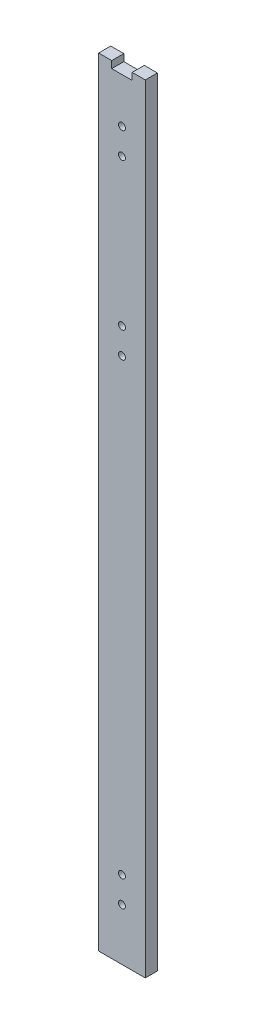
ISO-10303-21;
HEADER;
FILE_DESCRIPTION(('STEP AP214'),'2;1');
FILE_NAME('part.step','',(''),(''),'','','');
FILE_SCHEMA(('AUTOMOTIVE_DESIGN { 1 0 10303 214 1 1 1 1 }'));
ENDSEC;
DATA;
#1=APPLICATION_CONTEXT('core data for automotive mechanical design processes');
#2=APPLICATION_PROTOCOL_DEFINITION('international standard','automotive_design',2000,#1);
#3=PRODUCT_CONTEXT('',#1,'mechanical');
#4=PRODUCT('Part','Part','',(#3));
#5=PRODUCT_RELATED_PRODUCT_CATEGORY('part','',(#4));
#6=PRODUCT_DEFINITION_FORMATION('','',#4);
#7=PRODUCT_DEFINITION_CONTEXT('part definition',#1,'design');
#8=PRODUCT_DEFINITION('design','',#6,#7);
#9=PRODUCT_DEFINITION_SHAPE('','',#8);
#10=(LENGTH_UNIT() NAMED_UNIT(*) SI_UNIT(.MILLI.,.METRE.));
#11=(NAMED_UNIT(*) PLANE_ANGLE_UNIT() SI_UNIT($,.RADIAN.));
#12=(NAMED_UNIT(*) SI_UNIT($,.STERADIAN.) SOLID_ANGLE_UNIT());
#13=UNCERTAINTY_MEASURE_WITH_UNIT(LENGTH_MEASURE(1.E-05),#10,'distance_accuracy_value','');
#14=(GEOMETRIC_REPRESENTATION_CONTEXT(3) GLOBAL_UNCERTAINTY_ASSIGNED_CONTEXT((#13)) GLOBAL_UNIT_ASSIGNED_CONTEXT((#10,
#11,#12)) REPRESENTATION_CONTEXT('',''));
#15=CARTESIAN_POINT('',(0.,0.,0.));
#16=DIRECTION('',(0.,0.,1.));
#17=DIRECTION('',(1.,0.,0.));
#18=AXIS2_PLACEMENT_3D('',#15,#16,#17);
#19=CARTESIAN_POINT('',(0.,450.,0.));
#20=DIRECTION('',(0.,1.,0.));
#21=DIRECTION('',(0.,0.,1.));
#22=AXIS2_PLACEMENT_3D('',#19,#20,#21);
#23=PLANE('',#22);
#24=DIRECTION('',(0.,0.,1.));
#25=VECTOR('',#24,1.);
#26=CARTESIAN_POINT('',(-5.91396309482661,450.,0.));
#27=LINE('',#26,#25);
#28=CARTESIAN_POINT('',(-5.91396309482661,450.,-3.5));
#29=VERTEX_POINT('',#28);
#30=CARTESIAN_POINT('',(-5.91396309482661,450.,3.5));
#31=VERTEX_POINT('',#30);
#32=EDGE_CURVE('E11',#29,#31,#27,.T.);
#33=ORIENTED_EDGE('',*,*,#32,.F.);
#34=DIRECTION('',(-1.,0.,0.));
#35=VECTOR('',#34,1.);
#36=CARTESIAN_POINT('',(13.5,450.,-3.5));
#37=LINE('',#36,#35);
#38=CARTESIAN_POINT('',(-13.5,450.,-3.5));
#39=VERTEX_POINT('',#38);
#40=EDGE_CURVE('E56',#29,#39,#37,.T.);
#41=ORIENTED_EDGE('',*,*,#40,.T.);
#42=DIRECTION('',(0.,0.,1.));
#43=VECTOR('',#42,1.);
#44=CARTESIAN_POINT('',(-13.5,450.,3.5));
#45=LINE('',#44,#43);
#46=CARTESIAN_POINT('',(-13.5,450.,3.5));
#47=VERTEX_POINT('',#46);
#48=EDGE_CURVE('E138',#39,#47,#45,.T.);
#49=ORIENTED_EDGE('',*,*,#48,.T.);
#50=DIRECTION('',(1.,0.,0.));
#51=VECTOR('',#50,1.);
#52=CARTESIAN_POINT('',(13.5,450.,3.5));
#53=LINE('',#52,#51);
#54=EDGE_CURVE('E86',#47,#31,#53,.T.);
#55=ORIENTED_EDGE('',*,*,#54,.T.);
#56=EDGE_LOOP('',(#33,#41,#49,#55));
#57=FACE_BOUND('',#56,.T.);
#58=ADVANCED_FACE('F32',(#57),#23,.T.);
#59=CARTESIAN_POINT('',(-13.5,450.,3.5));
#60=DIRECTION('',(1.,0.,0.));
#61=DIRECTION('',(0.,0.,-1.));
#62=AXIS2_PLACEMENT_3D('',#59,#60,#61);
#63=PLANE('',#62);
#64=DIRECTION('',(0.,0.,1.));
#65=VECTOR('',#64,1.);
#66=CARTESIAN_POINT('',(-13.5,0.,3.5));
#67=LINE('',#66,#65);
#68=CARTESIAN_POINT('',(-13.5,0.,-3.5));
#69=VERTEX_POINT('',#68);
#70=CARTESIAN_POINT('',(-13.5,0.,3.5));
#71=VERTEX_POINT('',#70);
#72=EDGE_CURVE('E136',#69,#71,#67,.T.);
#73=ORIENTED_EDGE('',*,*,#72,.T.);
#74=DIRECTION('',(0.,-1.,0.));
#75=VECTOR('',#74,1.);
#76=CARTESIAN_POINT('',(-13.5,450.,3.5));
#77=LINE('',#76,#75);
#78=EDGE_CURVE('E160',#47,#71,#77,.T.);
#79=ORIENTED_EDGE('',*,*,#78,.F.);
#80=ORIENTED_EDGE('',*,*,#48,.F.);
#81=DIRECTION('',(0.,-1.,0.));
#82=VECTOR('',#81,1.);
#83=CARTESIAN_POINT('',(-13.5,450.,-3.5));
#84=LINE('',#83,#82);
#85=EDGE_CURVE('E146',#39,#69,#84,.T.);
#86=ORIENTED_EDGE('',*,*,#85,.T.);
#87=EDGE_LOOP('',(#73,#79,#80,#86));
#88=FACE_BOUND('',#87,.T.);
#89=ADVANCED_FACE('F34',(#88),#63,.F.);
#90=CARTESIAN_POINT('',(13.5,450.,3.5));
#91=DIRECTION('',(0.,0.,-1.));
#92=DIRECTION('',(-1.,0.,0.));
#93=AXIS2_PLACEMENT_3D('',#90,#91,#92);
#94=PLANE('',#93);
#95=CARTESIAN_POINT('',(0.,405.,3.50000000000001));
#96=DIRECTION('',(0.,0.,-1.));
#97=DIRECTION('',(-1.,0.,0.));
#98=AXIS2_PLACEMENT_3D('',#95,#96,#97);
#99=CIRCLE('',#98,2.);
#100=CARTESIAN_POINT('',(-2.00000000000001,405.,3.50000000000001));
#101=VERTEX_POINT('',#100);
#102=EDGE_CURVE('E206',#101,#101,#99,.T.);
#103=ORIENTED_EDGE('',*,*,#102,.T.);
#104=EDGE_LOOP('',(#103));
#105=FACE_BOUND('',#104,.T.);
#106=CARTESIAN_POINT('',(0.,320.,3.50000000000001));
#107=DIRECTION('',(0.,0.,-1.));
#108=DIRECTION('',(-1.,0.,0.));
#109=AXIS2_PLACEMENT_3D('',#106,#107,#108);
#110=CIRCLE('',#109,2.);
#111=CARTESIAN_POINT('',(-2.00000000000002,320.,3.50000000000001));
#112=VERTEX_POINT('',#111);
#113=EDGE_CURVE('E210',#112,#112,#110,.T.);
#114=ORIENTED_EDGE('',*,*,#113,.T.);
#115=EDGE_LOOP('',(#114));
#116=FACE_BOUND('',#115,.T.);
#117=CARTESIAN_POINT('',(0.,305.,3.50000000000001));
#118=DIRECTION('',(0.,0.,-1.));
#119=DIRECTION('',(-1.,0.,0.));
#120=AXIS2_PLACEMENT_3D('',#117,#118,#119);
#121=CIRCLE('',#120,1.99999999999999);
#122=CARTESIAN_POINT('',(-2.,305.,3.50000000000001));
#123=VERTEX_POINT('',#122);
#124=EDGE_CURVE('E214',#123,#123,#121,.T.);
#125=ORIENTED_EDGE('',*,*,#124,.T.);
#126=EDGE_LOOP('',(#125));
#127=FACE_BOUND('',#126,.T.);
#128=CARTESIAN_POINT('',(0.,30.,3.50000000000001));
#129=DIRECTION('',(0.,0.,-1.));
#130=DIRECTION('',(-1.,0.,0.));
#131=AXIS2_PLACEMENT_3D('',#128,#129,#130);
#132=CIRCLE('',#131,2.00000000000001);
#133=CARTESIAN_POINT('',(-2.00000000000006,30.,3.50000000000001));
#134=VERTEX_POINT('',#133);
#135=EDGE_CURVE('E218',#134,#134,#132,.T.);
#136=ORIENTED_EDGE('',*,*,#135,.T.);
#137=EDGE_LOOP('',(#136));
#138=FACE_BOUND('',#137,.T.);
#139=CARTESIAN_POINT('',(0.,45.,3.50000000000001));
#140=DIRECTION('',(0.,0.,-1.));
#141=DIRECTION('',(-1.,0.,0.));
#142=AXIS2_PLACEMENT_3D('',#139,#140,#141);
#143=CIRCLE('',#142,2.);
#144=CARTESIAN_POINT('',(-2.00000000000005,45.,3.50000000000001));
#145=VERTEX_POINT('',#144);
#146=EDGE_CURVE('E222',#145,#145,#143,.T.);
#147=ORIENTED_EDGE('',*,*,#146,.T.);
#148=EDGE_LOOP('',(#147));
#149=FACE_BOUND('',#148,.T.);
#150=CARTESIAN_POINT('',(0.,420.,3.50000000000001));
#151=DIRECTION('',(0.,0.,-1.));
#152=DIRECTION('',(-1.,0.,0.));
#153=AXIS2_PLACEMENT_3D('',#150,#151,#152);
#154=CIRCLE('',#153,2.);
#155=CARTESIAN_POINT('',(-2.,420.,3.50000000000001));
#156=VERTEX_POINT('',#155);
#157=EDGE_CURVE('E133',#156,#156,#154,.T.);
#158=ORIENTED_EDGE('',*,*,#157,.T.);
#159=EDGE_LOOP('',(#158));
#160=FACE_BOUND('',#159,.T.);
#161=DIRECTION('',(-1.,0.,0.));
#162=VECTOR('',#161,1.);
#163=CARTESIAN_POINT('',(5.91396309482661,445.958983682965,3.5));
#164=LINE('',#163,#162);
#165=CARTESIAN_POINT('',(5.91396309482661,445.958983682965,3.5));
#166=VERTEX_POINT('',#165);
#167=CARTESIAN_POINT('',(-5.91396309482661,445.958983682965,3.5));
#168=VERTEX_POINT('',#167);
#169=EDGE_CURVE('E115',#166,#168,#164,.T.);
#170=ORIENTED_EDGE('',*,*,#169,.T.);
#171=DIRECTION('',(0.,1.,0.));
#172=VECTOR('',#171,1.);
#173=CARTESIAN_POINT('',(-5.91396309482661,445.958983682965,3.5));
#174=LINE('',#173,#172);
#175=EDGE_CURVE('E125',#168,#31,#174,.T.);
#176=ORIENTED_EDGE('',*,*,#175,.T.);
#177=ORIENTED_EDGE('',*,*,#54,.F.);
#178=ORIENTED_EDGE('',*,*,#78,.T.);
#179=DIRECTION('',(1.,0.,0.));
#180=VECTOR('',#179,1.);
#181=CARTESIAN_POINT('',(13.5,0.,3.5));
#182=LINE('',#181,#180);
#183=CARTESIAN_POINT('',(13.5,0.,3.5));
#184=VERTEX_POINT('',#183);
#185=EDGE_CURVE('E149',#71,#184,#182,.T.);
#186=ORIENTED_EDGE('',*,*,#185,.T.);
#187=DIRECTION('',(0.,-1.,0.));
#188=VECTOR('',#187,1.);
#189=CARTESIAN_POINT('',(13.5,450.,3.5));
#190=LINE('',#189,#188);
#191=CARTESIAN_POINT('',(13.5,450.,3.5));
#192=VERTEX_POINT('',#191);
#193=EDGE_CURVE('E157',#192,#184,#190,.T.);
#194=ORIENTED_EDGE('',*,*,#193,.F.);
#195=CARTESIAN_POINT('',(5.91396309482661,450.,3.5));
#196=VERTEX_POINT('',#195);
#197=EDGE_CURVE('E124',#196,#192,#53,.T.);
#198=ORIENTED_EDGE('',*,*,#197,.F.);
#199=DIRECTION('',(0.,-1.,0.));
#200=VECTOR('',#199,1.);
#201=CARTESIAN_POINT('',(5.91396309482661,445.958983682965,3.5));
#202=LINE('',#201,#200);
#203=EDGE_CURVE('E47',#196,#166,#202,.T.);
#204=ORIENTED_EDGE('',*,*,#203,.T.);
#205=EDGE_LOOP('',(#170,#176,#177,#178,#186,#194,#198,#204));
#206=FACE_BOUND('',#205,.T.);
#207=ADVANCED_FACE('F122',(#105,#116,#127,#138,#149,#160,#206),#94,.F.);
#208=CARTESIAN_POINT('',(13.5,450.,3.5));
#209=DIRECTION('',(-1.,0.,0.));
#210=DIRECTION('',(0.,0.,1.));
#211=AXIS2_PLACEMENT_3D('',#208,#209,#210);
#212=PLANE('',#211);
#213=DIRECTION('',(0.,0.,-1.));
#214=VECTOR('',#213,1.);
#215=CARTESIAN_POINT('',(13.5,0.,3.5));
#216=LINE('',#215,#214);
#217=CARTESIAN_POINT('',(13.5,0.,-3.5));
#218=VERTEX_POINT('',#217);
#219=EDGE_CURVE('E151',#184,#218,#216,.T.);
#220=ORIENTED_EDGE('',*,*,#219,.T.);
#221=DIRECTION('',(0.,-1.,0.));
#222=VECTOR('',#221,1.);
#223=CARTESIAN_POINT('',(13.5,450.,-3.5));
#224=LINE('',#223,#222);
#225=CARTESIAN_POINT('',(13.5,450.,-3.5));
#226=VERTEX_POINT('',#225);
#227=EDGE_CURVE('E155',#226,#218,#224,.T.);
#228=ORIENTED_EDGE('',*,*,#227,.F.);
#229=DIRECTION('',(0.,0.,-1.));
#230=VECTOR('',#229,1.);
#231=CARTESIAN_POINT('',(13.5,450.,3.5));
#232=LINE('',#231,#230);
#233=EDGE_CURVE('E141',#192,#226,#232,.T.);
#234=ORIENTED_EDGE('',*,*,#233,.F.);
#235=ORIENTED_EDGE('',*,*,#193,.T.);
#236=EDGE_LOOP('',(#220,#228,#234,#235));
#237=FACE_BOUND('',#236,.T.);
#238=ADVANCED_FACE('F169',(#237),#212,.F.);
#239=CARTESIAN_POINT('',(13.5,450.,-3.5));
#240=DIRECTION('',(0.,0.,1.));
#241=DIRECTION('',(1.,0.,0.));
#242=AXIS2_PLACEMENT_3D('',#239,#240,#241);
#243=PLANE('',#242);
#244=CARTESIAN_POINT('',(0.,405.,-3.5));
#245=DIRECTION('',(0.,0.,-1.));
#246=DIRECTION('',(-1.,0.,0.));
#247=AXIS2_PLACEMENT_3D('',#244,#245,#246);
#248=CIRCLE('',#247,2.);
#249=CARTESIAN_POINT('',(-2.00000000000001,405.,-3.5));
#250=VERTEX_POINT('',#249);
#251=EDGE_CURVE('E246',#250,#250,#248,.T.);
#252=ORIENTED_EDGE('',*,*,#251,.F.);
#253=EDGE_LOOP('',(#252));
#254=FACE_BOUND('',#253,.T.);
#255=CARTESIAN_POINT('',(0.,320.,-3.5));
#256=DIRECTION('',(0.,0.,-1.));
#257=DIRECTION('',(-1.,0.,0.));
#258=AXIS2_PLACEMENT_3D('',#255,#256,#257);
#259=CIRCLE('',#258,2.);
#260=CARTESIAN_POINT('',(-2.00000000000002,320.,-3.5));
#261=VERTEX_POINT('',#260);
#262=EDGE_CURVE('E242',#261,#261,#259,.T.);
#263=ORIENTED_EDGE('',*,*,#262,.F.);
#264=EDGE_LOOP('',(#263));
#265=FACE_BOUND('',#264,.T.);
#266=CARTESIAN_POINT('',(0.,305.,-3.5));
#267=DIRECTION('',(0.,0.,-1.));
#268=DIRECTION('',(-1.,0.,0.));
#269=AXIS2_PLACEMENT_3D('',#266,#267,#268);
#270=CIRCLE('',#269,1.99999999999999);
#271=CARTESIAN_POINT('',(-2.00000000000001,305.,-3.5));
#272=VERTEX_POINT('',#271);
#273=EDGE_CURVE('E238',#272,#272,#270,.T.);
#274=ORIENTED_EDGE('',*,*,#273,.F.);
#275=EDGE_LOOP('',(#274));
#276=FACE_BOUND('',#275,.T.);
#277=CARTESIAN_POINT('',(0.,30.,-3.5));
#278=DIRECTION('',(0.,0.,-1.));
#279=DIRECTION('',(-1.,0.,0.));
#280=AXIS2_PLACEMENT_3D('',#277,#278,#279);
#281=CIRCLE('',#280,2.00000000000001);
#282=CARTESIAN_POINT('',(-2.00000000000006,30.,-3.5));
#283=VERTEX_POINT('',#282);
#284=EDGE_CURVE('E234',#283,#283,#281,.T.);
#285=ORIENTED_EDGE('',*,*,#284,.F.);
#286=EDGE_LOOP('',(#285));
#287=FACE_BOUND('',#286,.T.);
#288=CARTESIAN_POINT('',(0.,45.,-3.5));
#289=DIRECTION('',(0.,0.,-1.));
#290=DIRECTION('',(-1.,0.,0.));
#291=AXIS2_PLACEMENT_3D('',#288,#289,#290);
#292=CIRCLE('',#291,2.);
#293=CARTESIAN_POINT('',(-2.00000000000005,45.,-3.5));
#294=VERTEX_POINT('',#293);
#295=EDGE_CURVE('E230',#294,#294,#292,.T.);
#296=ORIENTED_EDGE('',*,*,#295,.F.);
#297=EDGE_LOOP('',(#296));
#298=FACE_BOUND('',#297,.T.);
#299=CARTESIAN_POINT('',(0.,420.,-3.5));
#300=DIRECTION('',(0.,0.,-1.));
#301=DIRECTION('',(-1.,0.,0.));
#302=AXIS2_PLACEMENT_3D('',#299,#300,#301);
#303=CIRCLE('',#302,2.);
#304=CARTESIAN_POINT('',(-2.,420.,-3.5));
#305=VERTEX_POINT('',#304);
#306=EDGE_CURVE('E226',#305,#305,#303,.T.);
#307=ORIENTED_EDGE('',*,*,#306,.F.);
#308=EDGE_LOOP('',(#307));
#309=FACE_BOUND('',#308,.T.);
#310=ORIENTED_EDGE('',*,*,#40,.F.);
#311=DIRECTION('',(0.,1.,0.));
#312=VECTOR('',#311,1.);
#313=CARTESIAN_POINT('',(-5.91396309482661,445.958983682965,-3.5));
#314=LINE('',#313,#312);
#315=CARTESIAN_POINT('',(-5.91396309482661,445.958983682965,-3.5));
#316=VERTEX_POINT('',#315);
#317=EDGE_CURVE('E131',#316,#29,#314,.T.);
#318=ORIENTED_EDGE('',*,*,#317,.F.);
#319=DIRECTION('',(-1.,0.,0.));
#320=VECTOR('',#319,1.);
#321=CARTESIAN_POINT('',(5.91396309482661,445.958983682965,-3.5));
#322=LINE('',#321,#320);
#323=CARTESIAN_POINT('',(5.91396309482661,445.958983682965,-3.5));
#324=VERTEX_POINT('',#323);
#325=EDGE_CURVE('E127',#324,#316,#322,.T.);
#326=ORIENTED_EDGE('',*,*,#325,.F.);
#327=DIRECTION('',(0.,-1.,0.));
#328=VECTOR('',#327,1.);
#329=CARTESIAN_POINT('',(5.91396309482661,445.958983682965,-3.5));
#330=LINE('',#329,#328);
#331=CARTESIAN_POINT('',(5.91396309482661,450.,-3.5));
#332=VERTEX_POINT('',#331);
#333=EDGE_CURVE('E110',#332,#324,#330,.T.);
#334=ORIENTED_EDGE('',*,*,#333,.F.);
#335=EDGE_CURVE('E143',#226,#332,#37,.T.);
#336=ORIENTED_EDGE('',*,*,#335,.F.);
#337=ORIENTED_EDGE('',*,*,#227,.T.);
#338=DIRECTION('',(-1.,0.,0.));
#339=VECTOR('',#338,1.);
#340=CARTESIAN_POINT('',(13.5,0.,-3.5));
#341=LINE('',#340,#339);
#342=EDGE_CURVE('E78',#218,#69,#341,.T.);
#343=ORIENTED_EDGE('',*,*,#342,.T.);
#344=ORIENTED_EDGE('',*,*,#85,.F.);
#345=EDGE_LOOP('',(#310,#318,#326,#334,#336,#337,#343,#344));
#346=FACE_BOUND('',#345,.T.);
#347=ADVANCED_FACE('F163',(#254,#265,#276,#287,#298,#309,#346),#243,.F.);
#348=DIRECTION('',(0.,0.,-1.));
#349=VECTOR('',#348,1.);
#350=CARTESIAN_POINT('',(5.91396309482661,450.,0.));
#351=LINE('',#350,#349);
#352=EDGE_CURVE('E40',#196,#332,#351,.T.);
#353=ORIENTED_EDGE('',*,*,#352,.F.);
#354=ORIENTED_EDGE('',*,*,#197,.T.);
#355=ORIENTED_EDGE('',*,*,#233,.T.);
#356=ORIENTED_EDGE('',*,*,#335,.T.);
#357=EDGE_LOOP('',(#353,#354,#355,#356));
#358=FACE_BOUND('',#357,.T.);
#359=ADVANCED_FACE('F165',(#358),#23,.T.);
#360=CARTESIAN_POINT('',(0.,0.,0.));
#361=DIRECTION('',(0.,1.,0.));
#362=DIRECTION('',(0.,0.,1.));
#363=AXIS2_PLACEMENT_3D('',#360,#361,#362);
#364=PLANE('',#363);
#365=ORIENTED_EDGE('',*,*,#72,.F.);
#366=ORIENTED_EDGE('',*,*,#342,.F.);
#367=ORIENTED_EDGE('',*,*,#219,.F.);
#368=ORIENTED_EDGE('',*,*,#185,.F.);
#369=EDGE_LOOP('',(#365,#366,#367,#368));
#370=FACE_BOUND('',#369,.T.);
#371=ADVANCED_FACE('F173',(#370),#364,.F.);
#372=CARTESIAN_POINT('',(-5.91396309482661,445.958983682965,3.5));
#373=DIRECTION('',(-1.,0.,0.));
#374=DIRECTION('',(0.,0.,1.));
#375=AXIS2_PLACEMENT_3D('',#372,#373,#374);
#376=PLANE('',#375);
#377=ORIENTED_EDGE('',*,*,#32,.T.);
#378=ORIENTED_EDGE('',*,*,#175,.F.);
#379=DIRECTION('',(0.,0.,-1.));
#380=VECTOR('',#379,1.);
#381=CARTESIAN_POINT('',(-5.91396309482661,445.958983682965,3.5));
#382=LINE('',#381,#380);
#383=EDGE_CURVE('E114',#168,#316,#382,.T.);
#384=ORIENTED_EDGE('',*,*,#383,.T.);
#385=ORIENTED_EDGE('',*,*,#317,.T.);
#386=EDGE_LOOP('',(#377,#378,#384,#385));
#387=FACE_BOUND('',#386,.T.);
#388=ADVANCED_FACE('F178',(#387),#376,.F.);
#389=CARTESIAN_POINT('',(5.91396309482661,445.958983682965,3.5));
#390=DIRECTION('',(0.,-1.,0.));
#391=DIRECTION('',(0.,0.,-1.));
#392=AXIS2_PLACEMENT_3D('',#389,#390,#391);
#393=PLANE('',#392);
#394=ORIENTED_EDGE('',*,*,#325,.T.);
#395=ORIENTED_EDGE('',*,*,#383,.F.);
#396=ORIENTED_EDGE('',*,*,#169,.F.);
#397=DIRECTION('',(0.,0.,-1.));
#398=VECTOR('',#397,1.);
#399=CARTESIAN_POINT('',(5.91396309482661,445.958983682965,3.5));
#400=LINE('',#399,#398);
#401=EDGE_CURVE('E106',#166,#324,#400,.T.);
#402=ORIENTED_EDGE('',*,*,#401,.T.);
#403=EDGE_LOOP('',(#394,#395,#396,#402));
#404=FACE_BOUND('',#403,.T.);
#405=ADVANCED_FACE('F118',(#404),#393,.F.);
#406=CARTESIAN_POINT('',(5.91396309482661,445.958983682965,3.5));
#407=DIRECTION('',(1.,0.,0.));
#408=DIRECTION('',(0.,0.,-1.));
#409=AXIS2_PLACEMENT_3D('',#406,#407,#408);
#410=PLANE('',#409);
#411=ORIENTED_EDGE('',*,*,#352,.T.);
#412=ORIENTED_EDGE('',*,*,#333,.T.);
#413=ORIENTED_EDGE('',*,*,#401,.F.);
#414=ORIENTED_EDGE('',*,*,#203,.F.);
#415=EDGE_LOOP('',(#411,#412,#413,#414));
#416=FACE_BOUND('',#415,.T.);
#417=ADVANCED_FACE('F108',(#416),#410,.F.);
#418=CARTESIAN_POINT('',(0.,420.,3.50000000000001));
#419=DIRECTION('',(0.,0.,-1.));
#420=DIRECTION('',(-1.,0.,0.));
#421=AXIS2_PLACEMENT_3D('',#418,#419,#420);
#422=CYLINDRICAL_SURFACE('',#421,2.);
#423=ORIENTED_EDGE('',*,*,#157,.F.);
#424=EDGE_LOOP('',(#423));
#425=FACE_BOUND('',#424,.T.);
#426=ORIENTED_EDGE('',*,*,#306,.T.);
#427=EDGE_LOOP('',(#426));
#428=FACE_BOUND('',#427,.T.);
#429=ADVANCED_FACE('F272',(#425,#428),#422,.F.);
#430=CARTESIAN_POINT('',(0.,45.,3.50000000000001));
#431=DIRECTION('',(0.,0.,-1.));
#432=DIRECTION('',(-1.,0.,0.));
#433=AXIS2_PLACEMENT_3D('',#430,#431,#432);
#434=CYLINDRICAL_SURFACE('',#433,2.);
#435=ORIENTED_EDGE('',*,*,#146,.F.);
#436=EDGE_LOOP('',(#435));
#437=FACE_BOUND('',#436,.T.);
#438=ORIENTED_EDGE('',*,*,#295,.T.);
#439=EDGE_LOOP('',(#438));
#440=FACE_BOUND('',#439,.T.);
#441=ADVANCED_FACE('F268',(#437,#440),#434,.F.);
#442=CARTESIAN_POINT('',(0.,30.,3.50000000000001));
#443=DIRECTION('',(0.,0.,-1.));
#444=DIRECTION('',(-1.,0.,0.));
#445=AXIS2_PLACEMENT_3D('',#442,#443,#444);
#446=CYLINDRICAL_SURFACE('',#445,2.00000000000001);
#447=ORIENTED_EDGE('',*,*,#135,.F.);
#448=EDGE_LOOP('',(#447));
#449=FACE_BOUND('',#448,.T.);
#450=ORIENTED_EDGE('',*,*,#284,.T.);
#451=EDGE_LOOP('',(#450));
#452=FACE_BOUND('',#451,.T.);
#453=ADVANCED_FACE('F264',(#449,#452),#446,.F.);
#454=CARTESIAN_POINT('',(0.,305.,3.50000000000001));
#455=DIRECTION('',(0.,0.,-1.));
#456=DIRECTION('',(-1.,0.,0.));
#457=AXIS2_PLACEMENT_3D('',#454,#455,#456);
#458=CYLINDRICAL_SURFACE('',#457,1.99999999999999);
#459=ORIENTED_EDGE('',*,*,#124,.F.);
#460=EDGE_LOOP('',(#459));
#461=FACE_BOUND('',#460,.T.);
#462=ORIENTED_EDGE('',*,*,#273,.T.);
#463=EDGE_LOOP('',(#462));
#464=FACE_BOUND('',#463,.T.);
#465=ADVANCED_FACE('F258',(#461,#464),#458,.F.);
#466=CARTESIAN_POINT('',(0.,320.,3.50000000000001));
#467=DIRECTION('',(0.,0.,-1.));
#468=DIRECTION('',(-1.,0.,0.));
#469=AXIS2_PLACEMENT_3D('',#466,#467,#468);
#470=CYLINDRICAL_SURFACE('',#469,2.);
#471=ORIENTED_EDGE('',*,*,#113,.F.);
#472=EDGE_LOOP('',(#471));
#473=FACE_BOUND('',#472,.T.);
#474=ORIENTED_EDGE('',*,*,#262,.T.);
#475=EDGE_LOOP('',(#474));
#476=FACE_BOUND('',#475,.T.);
#477=ADVANCED_FACE('F252',(#473,#476),#470,.F.);
#478=CARTESIAN_POINT('',(0.,405.,3.50000000000001));
#479=DIRECTION('',(0.,0.,-1.));
#480=DIRECTION('',(-1.,0.,0.));
#481=AXIS2_PLACEMENT_3D('',#478,#479,#480);
#482=CYLINDRICAL_SURFACE('',#481,2.);
#483=ORIENTED_EDGE('',*,*,#102,.F.);
#484=EDGE_LOOP('',(#483));
#485=FACE_BOUND('',#484,.T.);
#486=ORIENTED_EDGE('',*,*,#251,.T.);
#487=EDGE_LOOP('',(#486));
#488=FACE_BOUND('',#487,.T.);
#489=ADVANCED_FACE('F250',(#485,#488),#482,.F.);
#490=CLOSED_SHELL('',(#58,#89,#207,#238,#347,#359,#371,#388,#405,#417,#429,#441,#453,#465,#477,#489));
#491=MANIFOLD_SOLID_BREP('B2',#490);
#492=ADVANCED_BREP_SHAPE_REPRESENTATION('',(#18,#491),#14);
#493=SHAPE_DEFINITION_REPRESENTATION(#9,#492);
ENDSEC;
END-ISO-10303-21;
